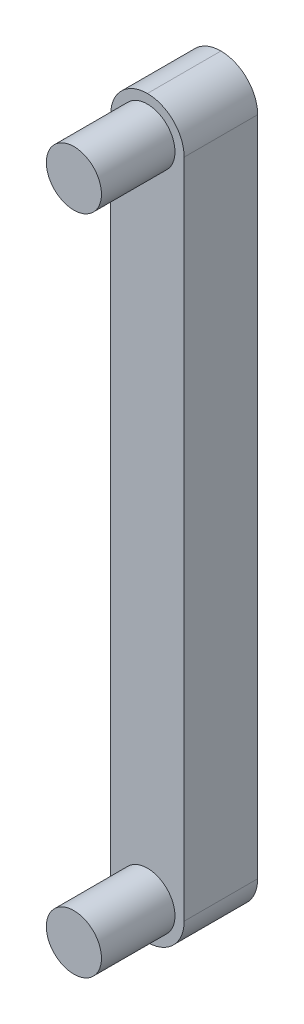
ISO-10303-21;
HEADER;
FILE_DESCRIPTION(('STEP AP214'),'2;1');
FILE_NAME('part.step','',(''),(''),'','','');
FILE_SCHEMA(('AUTOMOTIVE_DESIGN { 1 0 10303 214 1 1 1 1 }'));
ENDSEC;
DATA;
#1=APPLICATION_CONTEXT('core data for automotive mechanical design processes');
#2=APPLICATION_PROTOCOL_DEFINITION('international standard','automotive_design',2000,#1);
#3=PRODUCT_CONTEXT('',#1,'mechanical');
#4=PRODUCT('Part','Part','',(#3));
#5=PRODUCT_RELATED_PRODUCT_CATEGORY('part','',(#4));
#6=PRODUCT_DEFINITION_FORMATION('','',#4);
#7=PRODUCT_DEFINITION_CONTEXT('part definition',#1,'design');
#8=PRODUCT_DEFINITION('design','',#6,#7);
#9=PRODUCT_DEFINITION_SHAPE('','',#8);
#10=(LENGTH_UNIT() NAMED_UNIT(*) SI_UNIT(.MILLI.,.METRE.));
#11=(NAMED_UNIT(*) PLANE_ANGLE_UNIT() SI_UNIT($,.RADIAN.));
#12=(NAMED_UNIT(*) SI_UNIT($,.STERADIAN.) SOLID_ANGLE_UNIT());
#13=UNCERTAINTY_MEASURE_WITH_UNIT(LENGTH_MEASURE(1.E-05),#10,'distance_accuracy_value','');
#14=(GEOMETRIC_REPRESENTATION_CONTEXT(3) GLOBAL_UNCERTAINTY_ASSIGNED_CONTEXT((#13)) GLOBAL_UNIT_ASSIGNED_CONTEXT((#10,
#11,#12)) REPRESENTATION_CONTEXT('',''));
#15=CARTESIAN_POINT('',(0.,0.,0.));
#16=DIRECTION('',(0.,0.,1.));
#17=DIRECTION('',(1.,0.,0.));
#18=AXIS2_PLACEMENT_3D('',#15,#16,#17);
#19=CARTESIAN_POINT('',(10.,28.,18.));
#20=DIRECTION('',(0.,0.,1.));
#21=DIRECTION('',(1.,0.,0.));
#22=AXIS2_PLACEMENT_3D('',#19,#20,#21);
#23=CYLINDRICAL_SURFACE('',#22,8.);
#24=DIRECTION('',(0.,0.,1.));
#25=VECTOR('',#24,1.);
#26=CARTESIAN_POINT('',(10.,20.,18.));
#27=LINE('',#26,#25);
#28=CARTESIAN_POINT('',(10.,20.,18.));
#29=VERTEX_POINT('',#28);
#30=CARTESIAN_POINT('',(10.,20.,2.));
#31=VERTEX_POINT('',#30);
#32=EDGE_CURVE('E132',#29,#31,#27,.F.);
#33=ORIENTED_EDGE('',*,*,#32,.T.);
#34=CARTESIAN_POINT('',(10.,28.,2.));
#35=DIRECTION('',(0.,0.,-1.));
#36=DIRECTION('',(-1.,0.,0.));
#37=AXIS2_PLACEMENT_3D('',#34,#35,#36);
#38=CIRCLE('',#37,8.);
#39=CARTESIAN_POINT('',(18.,28.,2.));
#40=VERTEX_POINT('',#39);
#41=EDGE_CURVE('E60',#40,#31,#38,.T.);
#42=ORIENTED_EDGE('',*,*,#41,.F.);
#43=DIRECTION('',(0.,0.,1.));
#44=VECTOR('',#43,1.);
#45=CARTESIAN_POINT('',(18.,28.,18.));
#46=LINE('',#45,#44);
#47=CARTESIAN_POINT('',(18.,28.,18.));
#48=VERTEX_POINT('',#47);
#49=EDGE_CURVE('E138',#48,#40,#46,.F.);
#50=ORIENTED_EDGE('',*,*,#49,.F.);
#51=CARTESIAN_POINT('',(10.,28.,18.));
#52=DIRECTION('',(0.,0.,-1.));
#53=DIRECTION('',(-1.,0.,0.));
#54=AXIS2_PLACEMENT_3D('',#51,#52,#53);
#55=CIRCLE('',#54,8.);
#56=EDGE_CURVE('E53',#29,#48,#55,.F.);
#57=ORIENTED_EDGE('',*,*,#56,.F.);
#58=EDGE_LOOP('',(#33,#42,#50,#57));
#59=FACE_BOUND('',#58,.T.);
#60=ADVANCED_FACE('F39',(#59),#23,.T.);
#61=CARTESIAN_POINT('',(10.,28.,18.));
#62=DIRECTION('',(0.,0.,1.));
#63=DIRECTION('',(1.,0.,0.));
#64=AXIS2_PLACEMENT_3D('',#61,#62,#63);
#65=CYLINDRICAL_SURFACE('',#64,8.);
#66=DIRECTION('',(0.,0.,1.));
#67=VECTOR('',#66,1.);
#68=CARTESIAN_POINT('',(2.,28.,18.));
#69=LINE('',#68,#67);
#70=CARTESIAN_POINT('',(2.,28.,2.));
#71=VERTEX_POINT('',#70);
#72=CARTESIAN_POINT('',(2.,28.,18.));
#73=VERTEX_POINT('',#72);
#74=EDGE_CURVE('E103',#71,#73,#69,.T.);
#75=ORIENTED_EDGE('',*,*,#74,.F.);
#76=CARTESIAN_POINT('',(10.,28.,2.));
#77=DIRECTION('',(0.,0.,-1.));
#78=DIRECTION('',(-1.,0.,0.));
#79=AXIS2_PLACEMENT_3D('',#76,#77,#78);
#80=CIRCLE('',#79,8.);
#81=EDGE_CURVE('E134',#31,#71,#80,.T.);
#82=ORIENTED_EDGE('',*,*,#81,.F.);
#83=ORIENTED_EDGE('',*,*,#32,.F.);
#84=CARTESIAN_POINT('',(10.,28.,18.));
#85=DIRECTION('',(0.,0.,-1.));
#86=DIRECTION('',(-1.,0.,0.));
#87=AXIS2_PLACEMENT_3D('',#84,#85,#86);
#88=CIRCLE('',#87,8.);
#89=EDGE_CURVE('E136',#73,#29,#88,.F.);
#90=ORIENTED_EDGE('',*,*,#89,.F.);
#91=EDGE_LOOP('',(#75,#82,#83,#90));
#92=FACE_BOUND('',#91,.T.);
#93=ADVANCED_FACE('F157',(#92),#65,.T.);
#94=CARTESIAN_POINT('',(10.,172.,18.));
#95=DIRECTION('',(0.,0.,-1.));
#96=DIRECTION('',(-1.,0.,0.));
#97=AXIS2_PLACEMENT_3D('',#94,#95,#96);
#98=CYLINDRICAL_SURFACE('',#97,8.);
#99=DIRECTION('',(0.,0.,-1.));
#100=VECTOR('',#99,1.);
#101=CARTESIAN_POINT('',(2.,172.,18.));
#102=LINE('',#101,#100);
#103=CARTESIAN_POINT('',(2.,172.,18.));
#104=VERTEX_POINT('',#103);
#105=CARTESIAN_POINT('',(2.,172.,2.));
#106=VERTEX_POINT('',#105);
#107=EDGE_CURVE('E113',#104,#106,#102,.T.);
#108=ORIENTED_EDGE('',*,*,#107,.F.);
#109=CARTESIAN_POINT('',(10.,172.,18.));
#110=DIRECTION('',(0.,0.,-1.));
#111=DIRECTION('',(-1.,0.,0.));
#112=AXIS2_PLACEMENT_3D('',#109,#110,#111);
#113=CIRCLE('',#112,8.);
#114=CARTESIAN_POINT('',(10.,180.,18.));
#115=VERTEX_POINT('',#114);
#116=EDGE_CURVE('E104',#115,#104,#113,.F.);
#117=ORIENTED_EDGE('',*,*,#116,.F.);
#118=DIRECTION('',(0.,0.,-1.));
#119=VECTOR('',#118,1.);
#120=CARTESIAN_POINT('',(10.,180.,18.));
#121=LINE('',#120,#119);
#122=CARTESIAN_POINT('',(10.,180.,2.));
#123=VERTEX_POINT('',#122);
#124=EDGE_CURVE('E110',#115,#123,#121,.T.);
#125=ORIENTED_EDGE('',*,*,#124,.T.);
#126=CARTESIAN_POINT('',(10.,172.,2.));
#127=DIRECTION('',(0.,0.,-1.));
#128=DIRECTION('',(-1.,0.,0.));
#129=AXIS2_PLACEMENT_3D('',#126,#127,#128);
#130=CIRCLE('',#129,8.);
#131=EDGE_CURVE('E91',#106,#123,#130,.T.);
#132=ORIENTED_EDGE('',*,*,#131,.F.);
#133=EDGE_LOOP('',(#108,#117,#125,#132));
#134=FACE_BOUND('',#133,.T.);
#135=ADVANCED_FACE('F116',(#134),#98,.T.);
#136=CARTESIAN_POINT('',(10.,172.,18.));
#137=DIRECTION('',(0.,0.,-1.));
#138=DIRECTION('',(-1.,0.,0.));
#139=AXIS2_PLACEMENT_3D('',#136,#137,#138);
#140=CYLINDRICAL_SURFACE('',#139,8.);
#141=ORIENTED_EDGE('',*,*,#124,.F.);
#142=CARTESIAN_POINT('',(10.,172.,18.));
#143=DIRECTION('',(0.,0.,-1.));
#144=DIRECTION('',(-1.,0.,0.));
#145=AXIS2_PLACEMENT_3D('',#142,#143,#144);
#146=CIRCLE('',#145,8.);
#147=CARTESIAN_POINT('',(18.,172.,18.));
#148=VERTEX_POINT('',#147);
#149=EDGE_CURVE('E114',#148,#115,#146,.F.);
#150=ORIENTED_EDGE('',*,*,#149,.F.);
#151=DIRECTION('',(0.,0.,-1.));
#152=VECTOR('',#151,1.);
#153=CARTESIAN_POINT('',(18.,172.,18.));
#154=LINE('',#153,#152);
#155=CARTESIAN_POINT('',(18.,172.,2.));
#156=VERTEX_POINT('',#155);
#157=EDGE_CURVE('E112',#156,#148,#154,.F.);
#158=ORIENTED_EDGE('',*,*,#157,.F.);
#159=CARTESIAN_POINT('',(10.,172.,2.));
#160=DIRECTION('',(0.,0.,-1.));
#161=DIRECTION('',(-1.,0.,0.));
#162=AXIS2_PLACEMENT_3D('',#159,#160,#161);
#163=CIRCLE('',#162,8.);
#164=EDGE_CURVE('E95',#123,#156,#163,.T.);
#165=ORIENTED_EDGE('',*,*,#164,.F.);
#166=EDGE_LOOP('',(#141,#150,#158,#165));
#167=FACE_BOUND('',#166,.T.);
#168=ADVANCED_FACE('F108',(#167),#140,.T.);
#169=CARTESIAN_POINT('',(2.,20.,18.));
#170=DIRECTION('',(1.,0.,0.));
#171=DIRECTION('',(0.,0.,-1.));
#172=AXIS2_PLACEMENT_3D('',#169,#170,#171);
#173=PLANE('',#172);
#174=DIRECTION('',(0.,-1.,0.));
#175=VECTOR('',#174,1.);
#176=CARTESIAN_POINT('',(2.,20.,2.));
#177=LINE('',#176,#175);
#178=EDGE_CURVE('E98',#106,#71,#177,.T.);
#179=ORIENTED_EDGE('',*,*,#178,.T.);
#180=ORIENTED_EDGE('',*,*,#74,.T.);
#181=DIRECTION('',(0.,-1.,0.));
#182=VECTOR('',#181,1.);
#183=CARTESIAN_POINT('',(2.,20.,18.));
#184=LINE('',#183,#182);
#185=EDGE_CURVE('E121',#104,#73,#184,.T.);
#186=ORIENTED_EDGE('',*,*,#185,.F.);
#187=ORIENTED_EDGE('',*,*,#107,.T.);
#188=EDGE_LOOP('',(#179,#180,#186,#187));
#189=FACE_BOUND('',#188,.T.);
#190=ADVANCED_FACE('F161',(#189),#173,.F.);
#191=CARTESIAN_POINT('',(18.,20.,18.));
#192=DIRECTION('',(-1.,0.,0.));
#193=DIRECTION('',(0.,0.,1.));
#194=AXIS2_PLACEMENT_3D('',#191,#192,#193);
#195=PLANE('',#194);
#196=DIRECTION('',(0.,1.,0.));
#197=VECTOR('',#196,1.);
#198=CARTESIAN_POINT('',(18.,20.,18.));
#199=LINE('',#198,#197);
#200=EDGE_CURVE('E118',#48,#148,#199,.T.);
#201=ORIENTED_EDGE('',*,*,#200,.F.);
#202=ORIENTED_EDGE('',*,*,#49,.T.);
#203=DIRECTION('',(0.,1.,0.));
#204=VECTOR('',#203,1.);
#205=CARTESIAN_POINT('',(18.,20.,2.));
#206=LINE('',#205,#204);
#207=EDGE_CURVE('E124',#40,#156,#206,.T.);
#208=ORIENTED_EDGE('',*,*,#207,.T.);
#209=ORIENTED_EDGE('',*,*,#157,.T.);
#210=EDGE_LOOP('',(#201,#202,#208,#209));
#211=FACE_BOUND('',#210,.T.);
#212=ADVANCED_FACE('F148',(#211),#195,.F.);
#213=CARTESIAN_POINT('',(2.,20.,18.));
#214=DIRECTION('',(0.,0.,-1.));
#215=DIRECTION('',(-1.,0.,0.));
#216=AXIS2_PLACEMENT_3D('',#213,#214,#215);
#217=PLANE('',#216);
#218=CARTESIAN_POINT('',(10.,28.,18.));
#219=DIRECTION('',(0.,0.,-1.));
#220=DIRECTION('',(-1.,0.,0.));
#221=AXIS2_PLACEMENT_3D('',#218,#219,#220);
#222=CIRCLE('',#221,6.);
#223=CARTESIAN_POINT('',(4.,28.,18.));
#224=VERTEX_POINT('',#223);
#225=EDGE_CURVE('E11',#224,#224,#222,.F.);
#226=ORIENTED_EDGE('',*,*,#225,.F.);
#227=EDGE_LOOP('',(#226));
#228=FACE_BOUND('',#227,.T.);
#229=CARTESIAN_POINT('',(10.,172.,18.));
#230=DIRECTION('',(0.,0.,-1.));
#231=DIRECTION('',(-1.,0.,0.));
#232=AXIS2_PLACEMENT_3D('',#229,#230,#231);
#233=CIRCLE('',#232,6.);
#234=CARTESIAN_POINT('',(4.,172.,18.));
#235=VERTEX_POINT('',#234);
#236=EDGE_CURVE('E46',#235,#235,#233,.F.);
#237=ORIENTED_EDGE('',*,*,#236,.F.);
#238=EDGE_LOOP('',(#237));
#239=FACE_BOUND('',#238,.T.);
#240=ORIENTED_EDGE('',*,*,#89,.T.);
#241=ORIENTED_EDGE('',*,*,#56,.T.);
#242=ORIENTED_EDGE('',*,*,#200,.T.);
#243=ORIENTED_EDGE('',*,*,#149,.T.);
#244=ORIENTED_EDGE('',*,*,#116,.T.);
#245=ORIENTED_EDGE('',*,*,#185,.T.);
#246=EDGE_LOOP('',(#240,#241,#242,#243,#244,#245));
#247=FACE_BOUND('',#246,.T.);
#248=ADVANCED_FACE('F146',(#228,#239,#247),#217,.F.);
#249=CARTESIAN_POINT('',(2.,20.,2.));
#250=DIRECTION('',(0.,0.,-1.));
#251=DIRECTION('',(-1.,0.,0.));
#252=AXIS2_PLACEMENT_3D('',#249,#250,#251);
#253=PLANE('',#252);
#254=ORIENTED_EDGE('',*,*,#207,.F.);
#255=ORIENTED_EDGE('',*,*,#41,.T.);
#256=ORIENTED_EDGE('',*,*,#81,.T.);
#257=ORIENTED_EDGE('',*,*,#178,.F.);
#258=ORIENTED_EDGE('',*,*,#131,.T.);
#259=ORIENTED_EDGE('',*,*,#164,.T.);
#260=EDGE_LOOP('',(#254,#255,#256,#257,#258,#259));
#261=FACE_BOUND('',#260,.T.);
#262=ADVANCED_FACE('F94',(#261),#253,.T.);
#263=CARTESIAN_POINT('',(10.,172.,34.));
#264=DIRECTION('',(0.,0.,-1.));
#265=DIRECTION('',(-1.,0.,0.));
#266=AXIS2_PLACEMENT_3D('',#263,#264,#265);
#267=CYLINDRICAL_SURFACE('',#266,6.);
#268=CARTESIAN_POINT('',(10.,172.,34.));
#269=DIRECTION('',(0.,0.,1.));
#270=DIRECTION('',(1.,0.,0.));
#271=AXIS2_PLACEMENT_3D('',#268,#269,#270);
#272=CIRCLE('',#271,6.);
#273=CARTESIAN_POINT('',(16.,172.,34.));
#274=VERTEX_POINT('',#273);
#275=EDGE_CURVE('E164',#274,#274,#272,.T.);
#276=ORIENTED_EDGE('',*,*,#275,.F.);
#277=EDGE_LOOP('',(#276));
#278=FACE_BOUND('',#277,.T.);
#279=ORIENTED_EDGE('',*,*,#236,.T.);
#280=EDGE_LOOP('',(#279));
#281=FACE_BOUND('',#280,.T.);
#282=ADVANCED_FACE('F144',(#278,#281),#267,.T.);
#283=CARTESIAN_POINT('',(10.,172.,34.));
#284=DIRECTION('',(0.,0.,1.));
#285=DIRECTION('',(1.,0.,0.));
#286=AXIS2_PLACEMENT_3D('',#283,#284,#285);
#287=PLANE('',#286);
#288=ORIENTED_EDGE('',*,*,#275,.T.);
#289=EDGE_LOOP('',(#288));
#290=FACE_BOUND('',#289,.T.);
#291=ADVANCED_FACE('F178',(#290),#287,.T.);
#292=CARTESIAN_POINT('',(10.,28.,34.));
#293=DIRECTION('',(0.,0.,-1.));
#294=DIRECTION('',(-1.,0.,0.));
#295=AXIS2_PLACEMENT_3D('',#292,#293,#294);
#296=CYLINDRICAL_SURFACE('',#295,6.);
#297=CARTESIAN_POINT('',(10.,28.,34.));
#298=DIRECTION('',(0.,0.,1.));
#299=DIRECTION('',(1.,0.,0.));
#300=AXIS2_PLACEMENT_3D('',#297,#298,#299);
#301=CIRCLE('',#300,6.);
#302=CARTESIAN_POINT('',(16.,28.,34.));
#303=VERTEX_POINT('',#302);
#304=EDGE_CURVE('E167',#303,#303,#301,.T.);
#305=ORIENTED_EDGE('',*,*,#304,.F.);
#306=EDGE_LOOP('',(#305));
#307=FACE_BOUND('',#306,.T.);
#308=ORIENTED_EDGE('',*,*,#225,.T.);
#309=EDGE_LOOP('',(#308));
#310=FACE_BOUND('',#309,.T.);
#311=ADVANCED_FACE('F175',(#307,#310),#296,.T.);
#312=CARTESIAN_POINT('',(10.,28.,34.));
#313=DIRECTION('',(0.,0.,1.));
#314=DIRECTION('',(1.,0.,0.));
#315=AXIS2_PLACEMENT_3D('',#312,#313,#314);
#316=PLANE('',#315);
#317=ORIENTED_EDGE('',*,*,#304,.T.);
#318=EDGE_LOOP('',(#317));
#319=FACE_BOUND('',#318,.T.);
#320=ADVANCED_FACE('F173',(#319),#316,.T.);
#321=CLOSED_SHELL('',(#60,#93,#135,#168,#190,#212,#248,#262,#282,#291,#311,#320));
#322=MANIFOLD_SOLID_BREP('B2',#321);
#323=ADVANCED_BREP_SHAPE_REPRESENTATION('',(#18,#322),#14);
#324=SHAPE_DEFINITION_REPRESENTATION(#9,#323);
ENDSEC;
END-ISO-10303-21;
